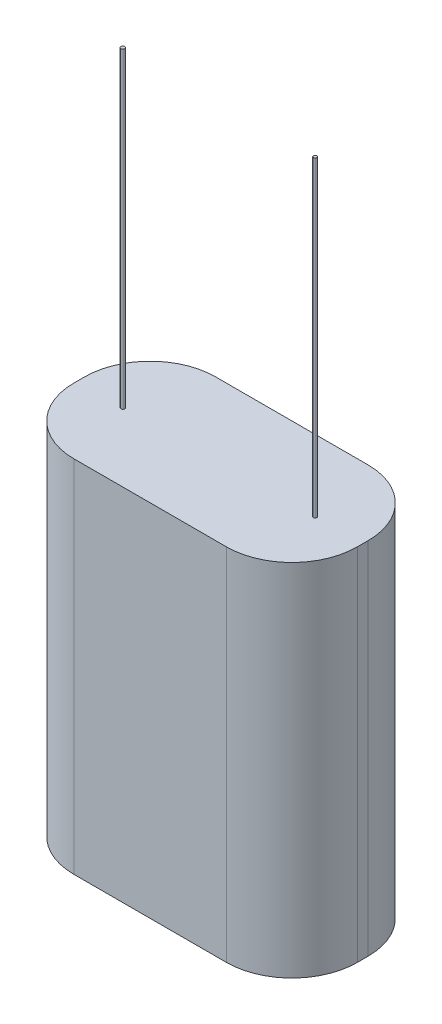
ISO-10303-21;
HEADER;
FILE_DESCRIPTION(('STEP AP214'),'2;1');
FILE_NAME('part.step','',(''),(''),'','','');
FILE_SCHEMA(('AUTOMOTIVE_DESIGN { 1 0 10303 214 1 1 1 1 }'));
ENDSEC;
DATA;
#1=APPLICATION_CONTEXT('core data for automotive mechanical design processes');
#2=APPLICATION_PROTOCOL_DEFINITION('international standard','automotive_design',2000,#1);
#3=PRODUCT_CONTEXT('',#1,'mechanical');
#4=PRODUCT('Part','Part','',(#3));
#5=PRODUCT_RELATED_PRODUCT_CATEGORY('part','',(#4));
#6=PRODUCT_DEFINITION_FORMATION('','',#4);
#7=PRODUCT_DEFINITION_CONTEXT('part definition',#1,'design');
#8=PRODUCT_DEFINITION('design','',#6,#7);
#9=PRODUCT_DEFINITION_SHAPE('','',#8);
#10=(LENGTH_UNIT() NAMED_UNIT(*) SI_UNIT(.MILLI.,.METRE.));
#11=(NAMED_UNIT(*) PLANE_ANGLE_UNIT() SI_UNIT($,.RADIAN.));
#12=(NAMED_UNIT(*) SI_UNIT($,.STERADIAN.) SOLID_ANGLE_UNIT());
#13=UNCERTAINTY_MEASURE_WITH_UNIT(LENGTH_MEASURE(1.E-05),#10,'distance_accuracy_value','');
#14=(GEOMETRIC_REPRESENTATION_CONTEXT(3) GLOBAL_UNCERTAINTY_ASSIGNED_CONTEXT((#13)) GLOBAL_UNIT_ASSIGNED_CONTEXT((#10,
#11,#12)) REPRESENTATION_CONTEXT('',''));
#15=CARTESIAN_POINT('',(0.,0.,0.));
#16=DIRECTION('',(0.,0.,1.));
#17=DIRECTION('',(1.,0.,0.));
#18=AXIS2_PLACEMENT_3D('',#15,#16,#17);
#19=CARTESIAN_POINT('',(-13.7650114183998,-10.9376967980246,8.255));
#20=DIRECTION('',(0.,-1.,0.));
#21=DIRECTION('',(0.,0.,-1.));
#22=AXIS2_PLACEMENT_3D('',#19,#20,#21);
#23=PLANE('',#22);
#24=CARTESIAN_POINT('',(0.,-10.9376967980246,4.16060347098579));
#25=DIRECTION('',(0.,-1.,0.));
#26=DIRECTION('',(0.,0.,-1.));
#27=AXIS2_PLACEMENT_3D('',#24,#25,#26);
#28=CIRCLE('',#27,0.0957791856919243);
#29=CARTESIAN_POINT('',(0.,-10.9376967980246,4.06482428529387));
#30=VERTEX_POINT('',#29);
#31=EDGE_CURVE('E41',#30,#30,#28,.F.);
#32=ORIENTED_EDGE('',*,*,#31,.F.);
#33=EDGE_LOOP('',(#32));
#34=FACE_BOUND('',#33,.T.);
#35=DIRECTION('',(-1.,0.,0.));
#36=VECTOR('',#35,1.);
#37=CARTESIAN_POINT('',(-13.7650114183998,-10.9376967980246,0.));
#38=LINE('',#37,#36);
#39=CARTESIAN_POINT('',(-1.06501141839981,-10.9376967980246,0.));
#40=VERTEX_POINT('',#39);
#41=CARTESIAN_POINT('',(-9.95501141839981,-10.9376967980246,0.));
#42=VERTEX_POINT('',#41);
#43=EDGE_CURVE('E165',#40,#42,#38,.T.);
#44=ORIENTED_EDGE('',*,*,#43,.T.);
#45=CARTESIAN_POINT('',(-9.95501141839981,-10.9376967980246,3.81));
#46=DIRECTION('',(0.,-1.,0.));
#47=DIRECTION('',(0.,0.,-1.));
#48=AXIS2_PLACEMENT_3D('',#45,#46,#47);
#49=CIRCLE('',#48,3.81);
#50=CARTESIAN_POINT('',(-13.7650114183998,-10.9376967980246,3.81));
#51=VERTEX_POINT('',#50);
#52=EDGE_CURVE('E144',#42,#51,#49,.F.);
#53=ORIENTED_EDGE('',*,*,#52,.T.);
#54=DIRECTION('',(0.,0.,-1.));
#55=VECTOR('',#54,1.);
#56=CARTESIAN_POINT('',(-13.7650114183998,-10.9376967980246,8.255));
#57=LINE('',#56,#55);
#58=CARTESIAN_POINT('',(-13.7650114183998,-10.9376967980246,4.445));
#59=VERTEX_POINT('',#58);
#60=EDGE_CURVE('E121',#59,#51,#57,.T.);
#61=ORIENTED_EDGE('',*,*,#60,.F.);
#62=CARTESIAN_POINT('',(-9.95501141839981,-10.9376967980246,4.445));
#63=DIRECTION('',(0.,-1.,0.));
#64=DIRECTION('',(0.,0.,-1.));
#65=AXIS2_PLACEMENT_3D('',#62,#63,#64);
#66=CIRCLE('',#65,3.81);
#67=CARTESIAN_POINT('',(-9.95501141839981,-10.9376967980246,8.255));
#68=VERTEX_POINT('',#67);
#69=EDGE_CURVE('E126',#59,#68,#66,.F.);
#70=ORIENTED_EDGE('',*,*,#69,.T.);
#71=DIRECTION('',(-1.,0.,0.));
#72=VECTOR('',#71,1.);
#73=CARTESIAN_POINT('',(-13.7650114183998,-10.9376967980246,8.255));
#74=LINE('',#73,#72);
#75=CARTESIAN_POINT('',(-1.06501141839981,-10.9376967980246,8.255));
#76=VERTEX_POINT('',#75);
#77=EDGE_CURVE('E223',#76,#68,#74,.T.);
#78=ORIENTED_EDGE('',*,*,#77,.F.);
#79=CARTESIAN_POINT('',(-1.06501141839981,-10.9376967980246,4.445));
#80=DIRECTION('',(0.,-1.,0.));
#81=DIRECTION('',(0.,0.,-1.));
#82=AXIS2_PLACEMENT_3D('',#79,#80,#81);
#83=CIRCLE('',#82,3.81);
#84=CARTESIAN_POINT('',(2.74498858160019,-10.9376967980246,4.445));
#85=VERTEX_POINT('',#84);
#86=EDGE_CURVE('E56',#76,#85,#83,.F.);
#87=ORIENTED_EDGE('',*,*,#86,.T.);
#88=DIRECTION('',(0.,0.,-1.));
#89=VECTOR('',#88,1.);
#90=CARTESIAN_POINT('',(2.74498858160019,-10.9376967980246,8.255));
#91=LINE('',#90,#89);
#92=CARTESIAN_POINT('',(2.74498858160019,-10.9376967980246,3.81));
#93=VERTEX_POINT('',#92);
#94=EDGE_CURVE('E127',#85,#93,#91,.T.);
#95=ORIENTED_EDGE('',*,*,#94,.T.);
#96=CARTESIAN_POINT('',(-1.06501141839981,-10.9376967980246,3.81));
#97=DIRECTION('',(0.,-1.,0.));
#98=DIRECTION('',(0.,0.,-1.));
#99=AXIS2_PLACEMENT_3D('',#96,#97,#98);
#100=CIRCLE('',#99,3.81);
#101=EDGE_CURVE('E48',#93,#40,#100,.F.);
#102=ORIENTED_EDGE('',*,*,#101,.T.);
#103=EDGE_LOOP('',(#44,#53,#61,#70,#78,#87,#95,#102));
#104=FACE_BOUND('',#103,.T.);
#105=CARTESIAN_POINT('',(-11.0939602888607,-10.9376967980246,4.25638265667772));
#106=DIRECTION('',(0.,-1.,0.));
#107=DIRECTION('',(0.,0.,-1.));
#108=AXIS2_PLACEMENT_3D('',#105,#106,#107);
#109=CIRCLE('',#108,0.112036590470423);
#110=CARTESIAN_POINT('',(-11.0939602888607,-10.9376967980246,4.14434606620729));
#111=VERTEX_POINT('',#110);
#112=EDGE_CURVE('E11',#111,#111,#109,.F.);
#113=ORIENTED_EDGE('',*,*,#112,.F.);
#114=EDGE_LOOP('',(#113));
#115=FACE_BOUND('',#114,.T.);
#116=ADVANCED_FACE('F33',(#34,#104,#115),#23,.F.);
#117=CARTESIAN_POINT('',(2.74498858160019,-31.8926967980246,8.255));
#118=DIRECTION('',(-1.,0.,0.));
#119=DIRECTION('',(0.,0.,1.));
#120=AXIS2_PLACEMENT_3D('',#117,#118,#119);
#121=PLANE('',#120);
#122=DIRECTION('',(0.,0.,-1.));
#123=VECTOR('',#122,1.);
#124=CARTESIAN_POINT('',(2.74498858160019,-31.8926967980246,8.255));
#125=LINE('',#124,#123);
#126=CARTESIAN_POINT('',(2.74498858160019,-31.8926967980246,4.445));
#127=VERTEX_POINT('',#126);
#128=CARTESIAN_POINT('',(2.74498858160019,-31.8926967980246,3.81));
#129=VERTEX_POINT('',#128);
#130=EDGE_CURVE('E122',#127,#129,#125,.T.);
#131=ORIENTED_EDGE('',*,*,#130,.T.);
#132=DIRECTION('',(0.,1.,0.));
#133=VECTOR('',#132,1.);
#134=CARTESIAN_POINT('',(2.74498858160019,-10.9376967980246,3.81));
#135=LINE('',#134,#133);
#136=EDGE_CURVE('E153',#129,#93,#135,.T.);
#137=ORIENTED_EDGE('',*,*,#136,.T.);
#138=ORIENTED_EDGE('',*,*,#94,.F.);
#139=DIRECTION('',(0.,1.,0.));
#140=VECTOR('',#139,1.);
#141=CARTESIAN_POINT('',(2.74498858160019,-31.8926967980246,4.445));
#142=LINE('',#141,#140);
#143=EDGE_CURVE('E151',#85,#127,#142,.F.);
#144=ORIENTED_EDGE('',*,*,#143,.T.);
#145=EDGE_LOOP('',(#131,#137,#138,#144));
#146=FACE_BOUND('',#145,.T.);
#147=ADVANCED_FACE('F160',(#146),#121,.F.);
#148=CARTESIAN_POINT('',(-13.7650114183998,-31.8926967980246,8.255));
#149=DIRECTION('',(1.,0.,0.));
#150=DIRECTION('',(0.,0.,-1.));
#151=AXIS2_PLACEMENT_3D('',#148,#149,#150);
#152=PLANE('',#151);
#153=ORIENTED_EDGE('',*,*,#60,.T.);
#154=DIRECTION('',(0.,-1.,0.));
#155=VECTOR('',#154,1.);
#156=CARTESIAN_POINT('',(-13.7650114183998,-31.8926967980246,3.81));
#157=LINE('',#156,#155);
#158=CARTESIAN_POINT('',(-13.7650114183998,-31.8926967980246,3.81));
#159=VERTEX_POINT('',#158);
#160=EDGE_CURVE('E120',#51,#159,#157,.T.);
#161=ORIENTED_EDGE('',*,*,#160,.T.);
#162=DIRECTION('',(0.,0.,-1.));
#163=VECTOR('',#162,1.);
#164=CARTESIAN_POINT('',(-13.7650114183998,-31.8926967980246,8.255));
#165=LINE('',#164,#163);
#166=CARTESIAN_POINT('',(-13.7650114183998,-31.8926967980246,4.445));
#167=VERTEX_POINT('',#166);
#168=EDGE_CURVE('E103',#167,#159,#165,.T.);
#169=ORIENTED_EDGE('',*,*,#168,.F.);
#170=DIRECTION('',(0.,-1.,0.));
#171=VECTOR('',#170,1.);
#172=CARTESIAN_POINT('',(-13.7650114183998,-31.8926967980246,4.445));
#173=LINE('',#172,#171);
#174=EDGE_CURVE('E117',#167,#59,#173,.F.);
#175=ORIENTED_EDGE('',*,*,#174,.T.);
#176=EDGE_LOOP('',(#153,#161,#169,#175));
#177=FACE_BOUND('',#176,.T.);
#178=ADVANCED_FACE('F116',(#177),#152,.F.);
#179=CARTESIAN_POINT('',(-13.7650114183998,-31.8926967980246,8.255));
#180=DIRECTION('',(0.,1.,0.));
#181=DIRECTION('',(0.,0.,1.));
#182=AXIS2_PLACEMENT_3D('',#179,#180,#181);
#183=PLANE('',#182);
#184=ORIENTED_EDGE('',*,*,#168,.T.);
#185=CARTESIAN_POINT('',(-9.95501141839981,-31.8926967980246,3.81));
#186=DIRECTION('',(0.,1.,0.));
#187=DIRECTION('',(0.,0.,1.));
#188=AXIS2_PLACEMENT_3D('',#185,#186,#187);
#189=CIRCLE('',#188,3.81);
#190=CARTESIAN_POINT('',(-9.95501141839981,-31.8926967980246,0.));
#191=VERTEX_POINT('',#190);
#192=EDGE_CURVE('E110',#159,#191,#189,.F.);
#193=ORIENTED_EDGE('',*,*,#192,.T.);
#194=DIRECTION('',(1.,0.,0.));
#195=VECTOR('',#194,1.);
#196=CARTESIAN_POINT('',(-13.7650114183998,-31.8926967980246,0.));
#197=LINE('',#196,#195);
#198=CARTESIAN_POINT('',(-1.06501141839981,-31.8926967980246,0.));
#199=VERTEX_POINT('',#198);
#200=EDGE_CURVE('E220',#191,#199,#197,.T.);
#201=ORIENTED_EDGE('',*,*,#200,.T.);
#202=CARTESIAN_POINT('',(-1.06501141839981,-31.8926967980246,3.81));
#203=DIRECTION('',(0.,1.,0.));
#204=DIRECTION('',(0.,0.,1.));
#205=AXIS2_PLACEMENT_3D('',#202,#203,#204);
#206=CIRCLE('',#205,3.81);
#207=EDGE_CURVE('E111',#199,#129,#206,.F.);
#208=ORIENTED_EDGE('',*,*,#207,.T.);
#209=ORIENTED_EDGE('',*,*,#130,.F.);
#210=CARTESIAN_POINT('',(-1.06501141839981,-31.8926967980246,4.445));
#211=DIRECTION('',(0.,1.,0.));
#212=DIRECTION('',(0.,0.,1.));
#213=AXIS2_PLACEMENT_3D('',#210,#211,#212);
#214=CIRCLE('',#213,3.81);
#215=CARTESIAN_POINT('',(-1.06501141839981,-31.8926967980246,8.255));
#216=VERTEX_POINT('',#215);
#217=EDGE_CURVE('E129',#127,#216,#214,.F.);
#218=ORIENTED_EDGE('',*,*,#217,.T.);
#219=DIRECTION('',(1.,0.,0.));
#220=VECTOR('',#219,1.);
#221=CARTESIAN_POINT('',(-13.7650114183998,-31.8926967980246,8.255));
#222=LINE('',#221,#220);
#223=CARTESIAN_POINT('',(-9.95501141839981,-31.8926967980246,8.255));
#224=VERTEX_POINT('',#223);
#225=EDGE_CURVE('E105',#224,#216,#222,.T.);
#226=ORIENTED_EDGE('',*,*,#225,.F.);
#227=CARTESIAN_POINT('',(-9.95501141839981,-31.8926967980246,4.445));
#228=DIRECTION('',(0.,1.,0.));
#229=DIRECTION('',(0.,0.,1.));
#230=AXIS2_PLACEMENT_3D('',#227,#228,#229);
#231=CIRCLE('',#230,3.81);
#232=EDGE_CURVE('E100',#224,#167,#231,.F.);
#233=ORIENTED_EDGE('',*,*,#232,.T.);
#234=EDGE_LOOP('',(#184,#193,#201,#208,#209,#218,#226,#233));
#235=FACE_BOUND('',#234,.T.);
#236=ADVANCED_FACE('F102',(#235),#183,.F.);
#237=CARTESIAN_POINT('',(0.,0.,8.255));
#238=DIRECTION('',(0.,0.,-1.));
#239=DIRECTION('',(-1.,0.,0.));
#240=AXIS2_PLACEMENT_3D('',#237,#238,#239);
#241=PLANE('',#240);
#242=ORIENTED_EDGE('',*,*,#77,.T.);
#243=DIRECTION('',(0.,-1.,0.));
#244=VECTOR('',#243,1.);
#245=CARTESIAN_POINT('',(-9.95501141839981,0.,8.255));
#246=LINE('',#245,#244);
#247=EDGE_CURVE('E149',#68,#224,#246,.T.);
#248=ORIENTED_EDGE('',*,*,#247,.T.);
#249=ORIENTED_EDGE('',*,*,#225,.T.);
#250=DIRECTION('',(0.,1.,0.));
#251=VECTOR('',#250,1.);
#252=CARTESIAN_POINT('',(-1.06501141839981,0.,8.255));
#253=LINE('',#252,#251);
#254=EDGE_CURVE('E146',#216,#76,#253,.T.);
#255=ORIENTED_EDGE('',*,*,#254,.T.);
#256=EDGE_LOOP('',(#242,#248,#249,#255));
#257=FACE_BOUND('',#256,.T.);
#258=ADVANCED_FACE('F188',(#257),#241,.F.);
#259=CARTESIAN_POINT('',(0.,0.,0.));
#260=DIRECTION('',(0.,0.,-1.));
#261=DIRECTION('',(-1.,0.,0.));
#262=AXIS2_PLACEMENT_3D('',#259,#260,#261);
#263=PLANE('',#262);
#264=ORIENTED_EDGE('',*,*,#200,.F.);
#265=DIRECTION('',(0.,-1.,0.));
#266=VECTOR('',#265,1.);
#267=CARTESIAN_POINT('',(-9.95501141839981,-10.9376967980246,0.));
#268=LINE('',#267,#266);
#269=EDGE_CURVE('E139',#191,#42,#268,.F.);
#270=ORIENTED_EDGE('',*,*,#269,.T.);
#271=ORIENTED_EDGE('',*,*,#43,.F.);
#272=DIRECTION('',(0.,1.,0.));
#273=VECTOR('',#272,1.);
#274=CARTESIAN_POINT('',(-1.06501141839981,-31.8926967980246,0.));
#275=LINE('',#274,#273);
#276=EDGE_CURVE('E137',#40,#199,#275,.F.);
#277=ORIENTED_EDGE('',*,*,#276,.T.);
#278=EDGE_LOOP('',(#264,#270,#271,#277));
#279=FACE_BOUND('',#278,.T.);
#280=ADVANCED_FACE('F191',(#279),#263,.T.);
#281=CARTESIAN_POINT('',(-9.95501141839981,-31.8926967980246,3.81));
#282=DIRECTION('',(0.,1.,0.));
#283=DIRECTION('',(0.,0.,1.));
#284=AXIS2_PLACEMENT_3D('',#281,#282,#283);
#285=CYLINDRICAL_SURFACE('',#284,3.81);
#286=ORIENTED_EDGE('',*,*,#52,.F.);
#287=ORIENTED_EDGE('',*,*,#269,.F.);
#288=ORIENTED_EDGE('',*,*,#192,.F.);
#289=ORIENTED_EDGE('',*,*,#160,.F.);
#290=EDGE_LOOP('',(#286,#287,#288,#289));
#291=FACE_BOUND('',#290,.T.);
#292=ADVANCED_FACE('F195',(#291),#285,.T.);
#293=CARTESIAN_POINT('',(-9.95501141839981,0.,4.445));
#294=DIRECTION('',(0.,-1.,0.));
#295=DIRECTION('',(0.,0.,-1.));
#296=AXIS2_PLACEMENT_3D('',#293,#294,#295);
#297=CYLINDRICAL_SURFACE('',#296,3.81);
#298=ORIENTED_EDGE('',*,*,#69,.F.);
#299=ORIENTED_EDGE('',*,*,#174,.F.);
#300=ORIENTED_EDGE('',*,*,#232,.F.);
#301=ORIENTED_EDGE('',*,*,#247,.F.);
#302=EDGE_LOOP('',(#298,#299,#300,#301));
#303=FACE_BOUND('',#302,.T.);
#304=ADVANCED_FACE('F125',(#303),#297,.T.);
#305=CARTESIAN_POINT('',(-1.06501141839981,-31.8926967980246,3.81));
#306=DIRECTION('',(0.,-1.,0.));
#307=DIRECTION('',(0.,0.,-1.));
#308=AXIS2_PLACEMENT_3D('',#305,#306,#307);
#309=CYLINDRICAL_SURFACE('',#308,3.81);
#310=ORIENTED_EDGE('',*,*,#207,.F.);
#311=ORIENTED_EDGE('',*,*,#276,.F.);
#312=ORIENTED_EDGE('',*,*,#101,.F.);
#313=ORIENTED_EDGE('',*,*,#136,.F.);
#314=EDGE_LOOP('',(#310,#311,#312,#313));
#315=FACE_BOUND('',#314,.T.);
#316=ADVANCED_FACE('F208',(#315),#309,.T.);
#317=CARTESIAN_POINT('',(-1.06501141839981,0.,4.445));
#318=DIRECTION('',(0.,1.,0.));
#319=DIRECTION('',(0.,0.,1.));
#320=AXIS2_PLACEMENT_3D('',#317,#318,#319);
#321=CYLINDRICAL_SURFACE('',#320,3.81);
#322=ORIENTED_EDGE('',*,*,#217,.F.);
#323=ORIENTED_EDGE('',*,*,#143,.F.);
#324=ORIENTED_EDGE('',*,*,#86,.F.);
#325=ORIENTED_EDGE('',*,*,#254,.F.);
#326=EDGE_LOOP('',(#322,#323,#324,#325));
#327=FACE_BOUND('',#326,.T.);
#328=ADVANCED_FACE('F35',(#327),#321,.T.);
#329=CARTESIAN_POINT('',(0.,7.22330320197536,4.16060347098579));
#330=DIRECTION('',(0.,-1.,0.));
#331=DIRECTION('',(0.,0.,-1.));
#332=AXIS2_PLACEMENT_3D('',#329,#330,#331);
#333=CYLINDRICAL_SURFACE('',#332,0.0957791856919243);
#334=CARTESIAN_POINT('',(0.,7.22330320197536,4.16060347098579));
#335=DIRECTION('',(0.,1.,0.));
#336=DIRECTION('',(0.,0.,1.));
#337=AXIS2_PLACEMENT_3D('',#334,#335,#336);
#338=CIRCLE('',#337,0.0957791856919243);
#339=CARTESIAN_POINT('',(0.,7.22330320197536,4.25638265667772));
#340=VERTEX_POINT('',#339);
#341=EDGE_CURVE('E230',#340,#340,#338,.T.);
#342=ORIENTED_EDGE('',*,*,#341,.F.);
#343=EDGE_LOOP('',(#342));
#344=FACE_BOUND('',#343,.T.);
#345=ORIENTED_EDGE('',*,*,#31,.T.);
#346=EDGE_LOOP('',(#345));
#347=FACE_BOUND('',#346,.T.);
#348=ADVANCED_FACE('F157',(#344,#347),#333,.T.);
#349=CARTESIAN_POINT('',(0.,7.22330320197536,4.16060347098579));
#350=DIRECTION('',(0.,1.,0.));
#351=DIRECTION('',(0.,0.,1.));
#352=AXIS2_PLACEMENT_3D('',#349,#350,#351);
#353=PLANE('',#352);
#354=ORIENTED_EDGE('',*,*,#341,.T.);
#355=EDGE_LOOP('',(#354));
#356=FACE_BOUND('',#355,.T.);
#357=ADVANCED_FACE('F172',(#356),#353,.T.);
#358=CARTESIAN_POINT('',(-11.0939602888607,7.22330320197536,4.25638265667772));
#359=DIRECTION('',(0.,-1.,0.));
#360=DIRECTION('',(0.,0.,-1.));
#361=AXIS2_PLACEMENT_3D('',#358,#359,#360);
#362=CYLINDRICAL_SURFACE('',#361,0.112036590470423);
#363=CARTESIAN_POINT('',(-11.0939602888607,7.22330320197536,4.25638265667772));
#364=DIRECTION('',(0.,1.,0.));
#365=DIRECTION('',(0.,0.,1.));
#366=AXIS2_PLACEMENT_3D('',#363,#364,#365);
#367=CIRCLE('',#366,0.112036590470423);
#368=CARTESIAN_POINT('',(-11.0939602888607,7.22330320197536,4.36841924714814));
#369=VERTEX_POINT('',#368);
#370=EDGE_CURVE('E232',#369,#369,#367,.T.);
#371=ORIENTED_EDGE('',*,*,#370,.F.);
#372=EDGE_LOOP('',(#371));
#373=FACE_BOUND('',#372,.T.);
#374=ORIENTED_EDGE('',*,*,#112,.T.);
#375=EDGE_LOOP('',(#374));
#376=FACE_BOUND('',#375,.T.);
#377=ADVANCED_FACE('F169',(#373,#376),#362,.T.);
#378=CARTESIAN_POINT('',(-11.0939602888607,7.22330320197536,4.25638265667772));
#379=DIRECTION('',(0.,1.,0.));
#380=DIRECTION('',(0.,0.,1.));
#381=AXIS2_PLACEMENT_3D('',#378,#379,#380);
#382=PLANE('',#381);
#383=ORIENTED_EDGE('',*,*,#370,.T.);
#384=EDGE_LOOP('',(#383));
#385=FACE_BOUND('',#384,.T.);
#386=ADVANCED_FACE('F171',(#385),#382,.T.);
#387=CLOSED_SHELL('',(#116,#147,#178,#236,#258,#280,#292,#304,#316,#328,#348,#357,#377,#386));
#388=MANIFOLD_SOLID_BREP('B2',#387);
#389=ADVANCED_BREP_SHAPE_REPRESENTATION('',(#18,#388),#14);
#390=SHAPE_DEFINITION_REPRESENTATION(#9,#389);
ENDSEC;
END-ISO-10303-21;
